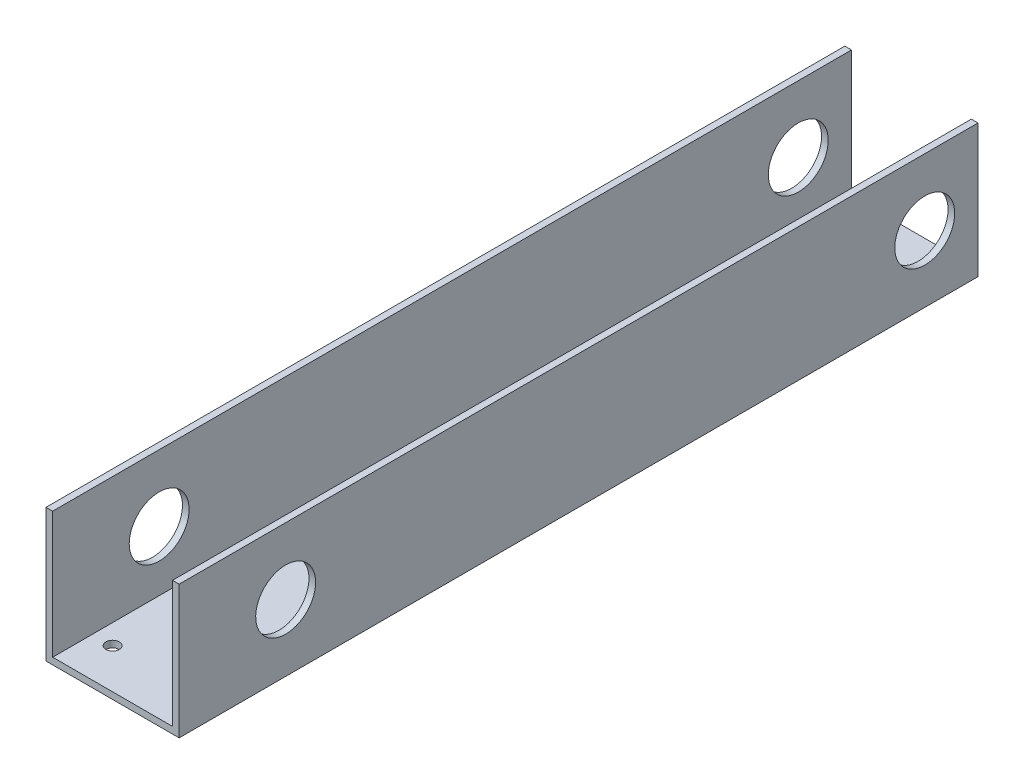
ISO-10303-21;
HEADER;
FILE_DESCRIPTION(('STEP AP214'),'2;1');
FILE_NAME('part.step','',(''),(''),'','','');
FILE_SCHEMA(('AUTOMOTIVE_DESIGN { 1 0 10303 214 1 1 1 1 }'));
ENDSEC;
DATA;
#1=APPLICATION_CONTEXT('core data for automotive mechanical design processes');
#2=APPLICATION_PROTOCOL_DEFINITION('international standard','automotive_design',2000,#1);
#3=PRODUCT_CONTEXT('',#1,'mechanical');
#4=PRODUCT('Part','Part','',(#3));
#5=PRODUCT_RELATED_PRODUCT_CATEGORY('part','',(#4));
#6=PRODUCT_DEFINITION_FORMATION('','',#4);
#7=PRODUCT_DEFINITION_CONTEXT('part definition',#1,'design');
#8=PRODUCT_DEFINITION('design','',#6,#7);
#9=PRODUCT_DEFINITION_SHAPE('','',#8);
#10=(LENGTH_UNIT() NAMED_UNIT(*) SI_UNIT(.MILLI.,.METRE.));
#11=(NAMED_UNIT(*) PLANE_ANGLE_UNIT() SI_UNIT($,.RADIAN.));
#12=(NAMED_UNIT(*) SI_UNIT($,.STERADIAN.) SOLID_ANGLE_UNIT());
#13=UNCERTAINTY_MEASURE_WITH_UNIT(LENGTH_MEASURE(1.E-05),#10,'distance_accuracy_value','');
#14=(GEOMETRIC_REPRESENTATION_CONTEXT(3) GLOBAL_UNCERTAINTY_ASSIGNED_CONTEXT((#13)) GLOBAL_UNIT_ASSIGNED_CONTEXT((#10,
#11,#12)) REPRESENTATION_CONTEXT('',''));
#15=CARTESIAN_POINT('',(0.,0.,0.));
#16=DIRECTION('',(0.,0.,1.));
#17=DIRECTION('',(1.,0.,0.));
#18=AXIS2_PLACEMENT_3D('',#15,#16,#17);
#19=CARTESIAN_POINT('',(0.,0.,381.));
#20=DIRECTION('',(1.,0.,0.));
#21=DIRECTION('',(0.,0.,-1.));
#22=AXIS2_PLACEMENT_3D('',#19,#20,#21);
#23=PLANE('',#22);
#24=CARTESIAN_POINT('',(0.,31.75,25.4));
#25=DIRECTION('',(1.,0.,0.));
#26=DIRECTION('',(0.,1.,0.));
#27=AXIS2_PLACEMENT_3D('',#24,#25,#26);
#28=CIRCLE('',#27,14.2875);
#29=CARTESIAN_POINT('',(0.,46.0375,25.4));
#30=VERTEX_POINT('',#29);
#31=EDGE_CURVE('E184',#30,#30,#28,.T.);
#32=ORIENTED_EDGE('',*,*,#31,.T.);
#33=EDGE_LOOP('',(#32));
#34=FACE_BOUND('',#33,.T.);
#35=CARTESIAN_POINT('',(0.,31.75,330.2));
#36=DIRECTION('',(1.,0.,0.));
#37=DIRECTION('',(0.,1.,0.));
#38=AXIS2_PLACEMENT_3D('',#35,#36,#37);
#39=CIRCLE('',#38,14.2875);
#40=CARTESIAN_POINT('',(0.,46.0375,330.2));
#41=VERTEX_POINT('',#40);
#42=EDGE_CURVE('E191',#41,#41,#39,.T.);
#43=ORIENTED_EDGE('',*,*,#42,.T.);
#44=EDGE_LOOP('',(#43));
#45=FACE_BOUND('',#44,.T.);
#46=DIRECTION('',(0.,-1.,0.));
#47=VECTOR('',#46,1.);
#48=CARTESIAN_POINT('',(0.,0.,0.));
#49=LINE('',#48,#47);
#50=CARTESIAN_POINT('',(0.,63.5,0.));
#51=VERTEX_POINT('',#50);
#52=CARTESIAN_POINT('',(0.,0.,0.));
#53=VERTEX_POINT('',#52);
#54=EDGE_CURVE('E131',#51,#53,#49,.T.);
#55=ORIENTED_EDGE('',*,*,#54,.T.);
#56=DIRECTION('',(0.,0.,-1.));
#57=VECTOR('',#56,1.);
#58=CARTESIAN_POINT('',(0.,0.,381.));
#59=LINE('',#58,#57);
#60=CARTESIAN_POINT('',(0.,0.,381.));
#61=VERTEX_POINT('',#60);
#62=EDGE_CURVE('E11',#61,#53,#59,.T.);
#63=ORIENTED_EDGE('',*,*,#62,.F.);
#64=DIRECTION('',(0.,-1.,0.));
#65=VECTOR('',#64,1.);
#66=CARTESIAN_POINT('',(0.,0.,381.));
#67=LINE('',#66,#65);
#68=CARTESIAN_POINT('',(0.,63.5,381.));
#69=VERTEX_POINT('',#68);
#70=EDGE_CURVE('E146',#69,#61,#67,.T.);
#71=ORIENTED_EDGE('',*,*,#70,.F.);
#72=DIRECTION('',(0.,0.,-1.));
#73=VECTOR('',#72,1.);
#74=CARTESIAN_POINT('',(0.,63.5,381.));
#75=LINE('',#74,#73);
#76=EDGE_CURVE('E127',#69,#51,#75,.T.);
#77=ORIENTED_EDGE('',*,*,#76,.T.);
#78=EDGE_LOOP('',(#55,#63,#71,#77));
#79=FACE_BOUND('',#78,.T.);
#80=ADVANCED_FACE('F33',(#34,#45,#79),#23,.F.);
#81=CARTESIAN_POINT('',(0.,0.,381.));
#82=DIRECTION('',(0.,1.,0.));
#83=DIRECTION('',(0.,0.,1.));
#84=AXIS2_PLACEMENT_3D('',#81,#82,#83);
#85=PLANE('',#84);
#86=CARTESIAN_POINT('',(12.7,0.,361.95));
#87=DIRECTION('',(0.,1.,0.));
#88=DIRECTION('',(0.,0.,1.));
#89=AXIS2_PLACEMENT_3D('',#86,#87,#88);
#90=CIRCLE('',#89,3.175);
#91=CARTESIAN_POINT('',(12.7,0.,365.125));
#92=VERTEX_POINT('',#91);
#93=EDGE_CURVE('E135',#92,#92,#90,.T.);
#94=ORIENTED_EDGE('',*,*,#93,.T.);
#95=EDGE_LOOP('',(#94));
#96=FACE_BOUND('',#95,.T.);
#97=CARTESIAN_POINT('',(50.8,0.,361.95));
#98=DIRECTION('',(0.,1.,0.));
#99=DIRECTION('',(0.,0.,1.));
#100=AXIS2_PLACEMENT_3D('',#97,#98,#99);
#101=CIRCLE('',#100,3.175);
#102=CARTESIAN_POINT('',(50.8,0.,365.125));
#103=VERTEX_POINT('',#102);
#104=EDGE_CURVE('E178',#103,#103,#101,.T.);
#105=ORIENTED_EDGE('',*,*,#104,.T.);
#106=EDGE_LOOP('',(#105));
#107=FACE_BOUND('',#106,.T.);
#108=CARTESIAN_POINT('',(50.8,0.,285.75));
#109=DIRECTION('',(0.,1.,0.));
#110=DIRECTION('',(0.,0.,1.));
#111=AXIS2_PLACEMENT_3D('',#108,#109,#110);
#112=CIRCLE('',#111,3.175);
#113=CARTESIAN_POINT('',(50.8,0.,288.925));
#114=VERTEX_POINT('',#113);
#115=EDGE_CURVE('E174',#114,#114,#112,.T.);
#116=ORIENTED_EDGE('',*,*,#115,.T.);
#117=EDGE_LOOP('',(#116));
#118=FACE_BOUND('',#117,.T.);
#119=CARTESIAN_POINT('',(50.8,0.,209.55));
#120=DIRECTION('',(0.,1.,0.));
#121=DIRECTION('',(0.,0.,1.));
#122=AXIS2_PLACEMENT_3D('',#119,#120,#121);
#123=CIRCLE('',#122,3.175);
#124=CARTESIAN_POINT('',(50.8,0.,212.725));
#125=VERTEX_POINT('',#124);
#126=EDGE_CURVE('E170',#125,#125,#123,.T.);
#127=ORIENTED_EDGE('',*,*,#126,.T.);
#128=EDGE_LOOP('',(#127));
#129=FACE_BOUND('',#128,.T.);
#130=CARTESIAN_POINT('',(50.8,0.,133.35));
#131=DIRECTION('',(0.,1.,0.));
#132=DIRECTION('',(0.,0.,1.));
#133=AXIS2_PLACEMENT_3D('',#130,#131,#132);
#134=CIRCLE('',#133,3.175);
#135=CARTESIAN_POINT('',(50.8,0.,136.525));
#136=VERTEX_POINT('',#135);
#137=EDGE_CURVE('E166',#136,#136,#134,.T.);
#138=ORIENTED_EDGE('',*,*,#137,.T.);
#139=EDGE_LOOP('',(#138));
#140=FACE_BOUND('',#139,.T.);
#141=CARTESIAN_POINT('',(50.8,0.,57.15));
#142=DIRECTION('',(0.,1.,0.));
#143=DIRECTION('',(0.,0.,1.));
#144=AXIS2_PLACEMENT_3D('',#141,#142,#143);
#145=CIRCLE('',#144,3.175);
#146=CARTESIAN_POINT('',(50.8,0.,60.325));
#147=VERTEX_POINT('',#146);
#148=EDGE_CURVE('E161',#147,#147,#145,.T.);
#149=ORIENTED_EDGE('',*,*,#148,.T.);
#150=EDGE_LOOP('',(#149));
#151=FACE_BOUND('',#150,.T.);
#152=DIRECTION('',(1.,0.,0.));
#153=VECTOR('',#152,1.);
#154=CARTESIAN_POINT('',(0.,0.,0.));
#155=LINE('',#154,#153);
#156=CARTESIAN_POINT('',(63.5,0.,0.));
#157=VERTEX_POINT('',#156);
#158=EDGE_CURVE('E134',#53,#157,#155,.T.);
#159=ORIENTED_EDGE('',*,*,#158,.T.);
#160=DIRECTION('',(0.,0.,-1.));
#161=VECTOR('',#160,1.);
#162=CARTESIAN_POINT('',(63.5,0.,381.));
#163=LINE('',#162,#161);
#164=CARTESIAN_POINT('',(63.5,0.,381.));
#165=VERTEX_POINT('',#164);
#166=EDGE_CURVE('E42',#165,#157,#163,.T.);
#167=ORIENTED_EDGE('',*,*,#166,.F.);
#168=DIRECTION('',(1.,0.,0.));
#169=VECTOR('',#168,1.);
#170=CARTESIAN_POINT('',(0.,0.,381.));
#171=LINE('',#170,#169);
#172=EDGE_CURVE('E94',#61,#165,#171,.T.);
#173=ORIENTED_EDGE('',*,*,#172,.F.);
#174=ORIENTED_EDGE('',*,*,#62,.T.);
#175=EDGE_LOOP('',(#159,#167,#173,#174));
#176=FACE_BOUND('',#175,.T.);
#177=ADVANCED_FACE('F252',(#96,#107,#118,#129,#140,#151,#176),#85,.F.);
#178=CARTESIAN_POINT('',(63.5,63.5,381.));
#179=DIRECTION('',(-1.,0.,0.));
#180=DIRECTION('',(0.,-1.,0.));
#181=AXIS2_PLACEMENT_3D('',#178,#179,#180);
#182=PLANE('',#181);
#183=CARTESIAN_POINT('',(63.5,31.75,25.4));
#184=DIRECTION('',(-1.,0.,0.));
#185=DIRECTION('',(0.,-1.,0.));
#186=AXIS2_PLACEMENT_3D('',#183,#184,#185);
#187=CIRCLE('',#186,14.2875);
#188=CARTESIAN_POINT('',(63.5,17.4625,25.4));
#189=VERTEX_POINT('',#188);
#190=EDGE_CURVE('E162',#189,#189,#187,.T.);
#191=ORIENTED_EDGE('',*,*,#190,.T.);
#192=EDGE_LOOP('',(#191));
#193=FACE_BOUND('',#192,.T.);
#194=CARTESIAN_POINT('',(63.5,31.75,330.2));
#195=DIRECTION('',(-1.,0.,0.));
#196=DIRECTION('',(0.,-1.,0.));
#197=AXIS2_PLACEMENT_3D('',#194,#195,#196);
#198=CIRCLE('',#197,14.2875);
#199=CARTESIAN_POINT('',(63.5,17.4624999999999,330.2));
#200=VERTEX_POINT('',#199);
#201=EDGE_CURVE('E188',#200,#200,#198,.T.);
#202=ORIENTED_EDGE('',*,*,#201,.T.);
#203=EDGE_LOOP('',(#202));
#204=FACE_BOUND('',#203,.T.);
#205=DIRECTION('',(0.,1.,0.));
#206=VECTOR('',#205,1.);
#207=CARTESIAN_POINT('',(63.5,63.5,0.));
#208=LINE('',#207,#206);
#209=CARTESIAN_POINT('',(63.5,63.5,0.));
#210=VERTEX_POINT('',#209);
#211=EDGE_CURVE('E137',#157,#210,#208,.T.);
#212=ORIENTED_EDGE('',*,*,#211,.T.);
#213=DIRECTION('',(0.,0.,-1.));
#214=VECTOR('',#213,1.);
#215=CARTESIAN_POINT('',(63.5,63.5,381.));
#216=LINE('',#215,#214);
#217=CARTESIAN_POINT('',(63.5,63.5,381.));
#218=VERTEX_POINT('',#217);
#219=EDGE_CURVE('E153',#218,#210,#216,.T.);
#220=ORIENTED_EDGE('',*,*,#219,.F.);
#221=DIRECTION('',(0.,1.,0.));
#222=VECTOR('',#221,1.);
#223=CARTESIAN_POINT('',(63.5,63.5,381.));
#224=LINE('',#223,#222);
#225=EDGE_CURVE('E219',#165,#218,#224,.T.);
#226=ORIENTED_EDGE('',*,*,#225,.F.);
#227=ORIENTED_EDGE('',*,*,#166,.T.);
#228=EDGE_LOOP('',(#212,#220,#226,#227));
#229=FACE_BOUND('',#228,.T.);
#230=ADVANCED_FACE('F258',(#193,#204,#229),#182,.F.);
#231=CARTESIAN_POINT('',(60.325,63.5,381.));
#232=DIRECTION('',(0.,-1.,0.));
#233=DIRECTION('',(0.,0.,-1.));
#234=AXIS2_PLACEMENT_3D('',#231,#232,#233);
#235=PLANE('',#234);
#236=DIRECTION('',(-1.,0.,0.));
#237=VECTOR('',#236,1.);
#238=CARTESIAN_POINT('',(60.325,63.5,0.));
#239=LINE('',#238,#237);
#240=CARTESIAN_POINT('',(60.325,63.5,0.));
#241=VERTEX_POINT('',#240);
#242=EDGE_CURVE('E139',#210,#241,#239,.T.);
#243=ORIENTED_EDGE('',*,*,#242,.T.);
#244=DIRECTION('',(0.,0.,-1.));
#245=VECTOR('',#244,1.);
#246=CARTESIAN_POINT('',(60.325,63.5,381.));
#247=LINE('',#246,#245);
#248=CARTESIAN_POINT('',(60.325,63.5,381.));
#249=VERTEX_POINT('',#248);
#250=EDGE_CURVE('E150',#249,#241,#247,.T.);
#251=ORIENTED_EDGE('',*,*,#250,.F.);
#252=DIRECTION('',(-1.,0.,0.));
#253=VECTOR('',#252,1.);
#254=CARTESIAN_POINT('',(60.325,63.5,381.));
#255=LINE('',#254,#253);
#256=EDGE_CURVE('E221',#218,#249,#255,.T.);
#257=ORIENTED_EDGE('',*,*,#256,.F.);
#258=ORIENTED_EDGE('',*,*,#219,.T.);
#259=EDGE_LOOP('',(#243,#251,#257,#258));
#260=FACE_BOUND('',#259,.T.);
#261=ADVANCED_FACE('F227',(#260),#235,.F.);
#262=CARTESIAN_POINT('',(60.325,3.175,381.));
#263=DIRECTION('',(1.,0.,0.));
#264=DIRECTION('',(0.,0.,-1.));
#265=AXIS2_PLACEMENT_3D('',#262,#263,#264);
#266=PLANE('',#265);
#267=CARTESIAN_POINT('',(60.325,31.75,25.4));
#268=DIRECTION('',(1.,0.,0.));
#269=DIRECTION('',(0.,0.,-1.));
#270=AXIS2_PLACEMENT_3D('',#267,#268,#269);
#271=CIRCLE('',#270,14.2875);
#272=CARTESIAN_POINT('',(60.325,31.75,11.1125));
#273=VERTEX_POINT('',#272);
#274=EDGE_CURVE('E200',#273,#273,#271,.T.);
#275=ORIENTED_EDGE('',*,*,#274,.T.);
#276=EDGE_LOOP('',(#275));
#277=FACE_BOUND('',#276,.T.);
#278=CARTESIAN_POINT('',(60.325,31.75,330.2));
#279=DIRECTION('',(1.,0.,0.));
#280=DIRECTION('',(0.,0.,-1.));
#281=AXIS2_PLACEMENT_3D('',#278,#279,#280);
#282=CIRCLE('',#281,14.2875);
#283=CARTESIAN_POINT('',(60.325,31.75,315.9125));
#284=VERTEX_POINT('',#283);
#285=EDGE_CURVE('E183',#284,#284,#282,.T.);
#286=ORIENTED_EDGE('',*,*,#285,.T.);
#287=EDGE_LOOP('',(#286));
#288=FACE_BOUND('',#287,.T.);
#289=DIRECTION('',(0.,-1.,0.));
#290=VECTOR('',#289,1.);
#291=CARTESIAN_POINT('',(60.325,3.175,0.));
#292=LINE('',#291,#290);
#293=CARTESIAN_POINT('',(60.325,3.175,0.));
#294=VERTEX_POINT('',#293);
#295=EDGE_CURVE('E141',#241,#294,#292,.T.);
#296=ORIENTED_EDGE('',*,*,#295,.T.);
#297=DIRECTION('',(0.,0.,-1.));
#298=VECTOR('',#297,1.);
#299=CARTESIAN_POINT('',(60.325,3.175,381.));
#300=LINE('',#299,#298);
#301=CARTESIAN_POINT('',(60.325,3.175,381.));
#302=VERTEX_POINT('',#301);
#303=EDGE_CURVE('E122',#302,#294,#300,.T.);
#304=ORIENTED_EDGE('',*,*,#303,.F.);
#305=DIRECTION('',(0.,-1.,0.));
#306=VECTOR('',#305,1.);
#307=CARTESIAN_POINT('',(60.325,3.175,381.));
#308=LINE('',#307,#306);
#309=EDGE_CURVE('E113',#249,#302,#308,.T.);
#310=ORIENTED_EDGE('',*,*,#309,.F.);
#311=ORIENTED_EDGE('',*,*,#250,.T.);
#312=EDGE_LOOP('',(#296,#304,#310,#311));
#313=FACE_BOUND('',#312,.T.);
#314=ADVANCED_FACE('F231',(#277,#288,#313),#266,.F.);
#315=CARTESIAN_POINT('',(3.17500000000001,3.175,381.));
#316=DIRECTION('',(0.,-1.,0.));
#317=DIRECTION('',(1.,0.,0.));
#318=AXIS2_PLACEMENT_3D('',#315,#316,#317);
#319=PLANE('',#318);
#320=CARTESIAN_POINT('',(12.7,3.175,361.95));
#321=DIRECTION('',(0.,-1.,0.));
#322=DIRECTION('',(1.,0.,0.));
#323=AXIS2_PLACEMENT_3D('',#320,#321,#322);
#324=CIRCLE('',#323,3.175);
#325=CARTESIAN_POINT('',(15.875,3.175,361.95));
#326=VERTEX_POINT('',#325);
#327=EDGE_CURVE('E179',#326,#326,#324,.T.);
#328=ORIENTED_EDGE('',*,*,#327,.T.);
#329=EDGE_LOOP('',(#328));
#330=FACE_BOUND('',#329,.T.);
#331=CARTESIAN_POINT('',(50.8,3.175,361.95));
#332=DIRECTION('',(0.,-1.,0.));
#333=DIRECTION('',(1.,0.,0.));
#334=AXIS2_PLACEMENT_3D('',#331,#332,#333);
#335=CIRCLE('',#334,3.175);
#336=CARTESIAN_POINT('',(53.975,3.175,361.95));
#337=VERTEX_POINT('',#336);
#338=EDGE_CURVE('E175',#337,#337,#335,.T.);
#339=ORIENTED_EDGE('',*,*,#338,.T.);
#340=EDGE_LOOP('',(#339));
#341=FACE_BOUND('',#340,.T.);
#342=CARTESIAN_POINT('',(50.8,3.175,285.75));
#343=DIRECTION('',(0.,-1.,0.));
#344=DIRECTION('',(1.,0.,0.));
#345=AXIS2_PLACEMENT_3D('',#342,#343,#344);
#346=CIRCLE('',#345,3.175);
#347=CARTESIAN_POINT('',(53.975,3.175,285.75));
#348=VERTEX_POINT('',#347);
#349=EDGE_CURVE('E171',#348,#348,#346,.T.);
#350=ORIENTED_EDGE('',*,*,#349,.T.);
#351=EDGE_LOOP('',(#350));
#352=FACE_BOUND('',#351,.T.);
#353=CARTESIAN_POINT('',(50.8,3.175,209.55));
#354=DIRECTION('',(0.,-1.,0.));
#355=DIRECTION('',(1.,0.,0.));
#356=AXIS2_PLACEMENT_3D('',#353,#354,#355);
#357=CIRCLE('',#356,3.175);
#358=CARTESIAN_POINT('',(53.975,3.175,209.55));
#359=VERTEX_POINT('',#358);
#360=EDGE_CURVE('E167',#359,#359,#357,.T.);
#361=ORIENTED_EDGE('',*,*,#360,.T.);
#362=EDGE_LOOP('',(#361));
#363=FACE_BOUND('',#362,.T.);
#364=CARTESIAN_POINT('',(50.8,3.175,133.35));
#365=DIRECTION('',(0.,-1.,0.));
#366=DIRECTION('',(1.,0.,0.));
#367=AXIS2_PLACEMENT_3D('',#364,#365,#366);
#368=CIRCLE('',#367,3.175);
#369=CARTESIAN_POINT('',(53.975,3.175,133.35));
#370=VERTEX_POINT('',#369);
#371=EDGE_CURVE('E163',#370,#370,#368,.T.);
#372=ORIENTED_EDGE('',*,*,#371,.T.);
#373=EDGE_LOOP('',(#372));
#374=FACE_BOUND('',#373,.T.);
#375=CARTESIAN_POINT('',(50.8,3.175,57.15));
#376=DIRECTION('',(0.,-1.,0.));
#377=DIRECTION('',(1.,0.,0.));
#378=AXIS2_PLACEMENT_3D('',#375,#376,#377);
#379=CIRCLE('',#378,3.175);
#380=CARTESIAN_POINT('',(53.975,3.175,57.15));
#381=VERTEX_POINT('',#380);
#382=EDGE_CURVE('E158',#381,#381,#379,.T.);
#383=ORIENTED_EDGE('',*,*,#382,.T.);
#384=EDGE_LOOP('',(#383));
#385=FACE_BOUND('',#384,.T.);
#386=DIRECTION('',(-1.,0.,0.));
#387=VECTOR('',#386,1.);
#388=CARTESIAN_POINT('',(3.17500000000001,3.175,0.));
#389=LINE('',#388,#387);
#390=CARTESIAN_POINT('',(3.17500000000001,3.175,0.));
#391=VERTEX_POINT('',#390);
#392=EDGE_CURVE('E121',#294,#391,#389,.T.);
#393=ORIENTED_EDGE('',*,*,#392,.T.);
#394=DIRECTION('',(0.,0.,-1.));
#395=VECTOR('',#394,1.);
#396=CARTESIAN_POINT('',(3.17500000000001,3.175,381.));
#397=LINE('',#396,#395);
#398=CARTESIAN_POINT('',(3.17500000000001,3.175,381.));
#399=VERTEX_POINT('',#398);
#400=EDGE_CURVE('E118',#399,#391,#397,.T.);
#401=ORIENTED_EDGE('',*,*,#400,.F.);
#402=DIRECTION('',(-1.,0.,0.));
#403=VECTOR('',#402,1.);
#404=CARTESIAN_POINT('',(3.17500000000001,3.175,381.));
#405=LINE('',#404,#403);
#406=EDGE_CURVE('E107',#302,#399,#405,.T.);
#407=ORIENTED_EDGE('',*,*,#406,.F.);
#408=ORIENTED_EDGE('',*,*,#303,.T.);
#409=EDGE_LOOP('',(#393,#401,#407,#408));
#410=FACE_BOUND('',#409,.T.);
#411=ADVANCED_FACE('F119',(#330,#341,#352,#363,#374,#385,#410),#319,.F.);
#412=CARTESIAN_POINT('',(3.175,63.5,381.));
#413=DIRECTION('',(-1.,0.,0.));
#414=DIRECTION('',(0.,-1.,0.));
#415=AXIS2_PLACEMENT_3D('',#412,#413,#414);
#416=PLANE('',#415);
#417=CARTESIAN_POINT('',(3.175,31.75,25.4));
#418=DIRECTION('',(-1.,0.,0.));
#419=DIRECTION('',(0.,-1.,0.));
#420=AXIS2_PLACEMENT_3D('',#417,#418,#419);
#421=CIRCLE('',#420,14.2875);
#422=CARTESIAN_POINT('',(3.17500000000001,17.4625,25.4));
#423=VERTEX_POINT('',#422);
#424=EDGE_CURVE('E36',#423,#423,#421,.T.);
#425=ORIENTED_EDGE('',*,*,#424,.T.);
#426=EDGE_LOOP('',(#425));
#427=FACE_BOUND('',#426,.T.);
#428=CARTESIAN_POINT('',(3.175,31.75,330.2));
#429=DIRECTION('',(-1.,0.,0.));
#430=DIRECTION('',(0.,-1.,0.));
#431=AXIS2_PLACEMENT_3D('',#428,#429,#430);
#432=CIRCLE('',#431,14.2875);
#433=CARTESIAN_POINT('',(3.17500000000001,17.4624999999999,330.2));
#434=VERTEX_POINT('',#433);
#435=EDGE_CURVE('E181',#434,#434,#432,.T.);
#436=ORIENTED_EDGE('',*,*,#435,.T.);
#437=EDGE_LOOP('',(#436));
#438=FACE_BOUND('',#437,.T.);
#439=DIRECTION('',(0.,1.,0.));
#440=VECTOR('',#439,1.);
#441=CARTESIAN_POINT('',(3.175,63.5,0.));
#442=LINE('',#441,#440);
#443=CARTESIAN_POINT('',(3.175,63.5,0.));
#444=VERTEX_POINT('',#443);
#445=EDGE_CURVE('E80',#391,#444,#442,.T.);
#446=ORIENTED_EDGE('',*,*,#445,.T.);
#447=DIRECTION('',(0.,0.,-1.));
#448=VECTOR('',#447,1.);
#449=CARTESIAN_POINT('',(3.175,63.5,381.));
#450=LINE('',#449,#448);
#451=CARTESIAN_POINT('',(3.175,63.5,381.));
#452=VERTEX_POINT('',#451);
#453=EDGE_CURVE('E123',#452,#444,#450,.T.);
#454=ORIENTED_EDGE('',*,*,#453,.F.);
#455=DIRECTION('',(0.,1.,0.));
#456=VECTOR('',#455,1.);
#457=CARTESIAN_POINT('',(3.175,63.5,381.));
#458=LINE('',#457,#456);
#459=EDGE_CURVE('E111',#399,#452,#458,.T.);
#460=ORIENTED_EDGE('',*,*,#459,.F.);
#461=ORIENTED_EDGE('',*,*,#400,.T.);
#462=EDGE_LOOP('',(#446,#454,#460,#461));
#463=FACE_BOUND('',#462,.T.);
#464=ADVANCED_FACE('F125',(#427,#438,#463),#416,.F.);
#465=CARTESIAN_POINT('',(0.,63.5,381.));
#466=DIRECTION('',(0.,-1.,0.));
#467=DIRECTION('',(0.,0.,-1.));
#468=AXIS2_PLACEMENT_3D('',#465,#466,#467);
#469=PLANE('',#468);
#470=DIRECTION('',(-1.,0.,0.));
#471=VECTOR('',#470,1.);
#472=CARTESIAN_POINT('',(0.,63.5,0.));
#473=LINE('',#472,#471);
#474=EDGE_CURVE('E86',#444,#51,#473,.T.);
#475=ORIENTED_EDGE('',*,*,#474,.T.);
#476=ORIENTED_EDGE('',*,*,#76,.F.);
#477=DIRECTION('',(-1.,0.,0.));
#478=VECTOR('',#477,1.);
#479=CARTESIAN_POINT('',(0.,63.5,381.));
#480=LINE('',#479,#478);
#481=EDGE_CURVE('E51',#452,#69,#480,.T.);
#482=ORIENTED_EDGE('',*,*,#481,.F.);
#483=ORIENTED_EDGE('',*,*,#453,.T.);
#484=EDGE_LOOP('',(#475,#476,#482,#483));
#485=FACE_BOUND('',#484,.T.);
#486=ADVANCED_FACE('F239',(#485),#469,.F.);
#487=CARTESIAN_POINT('',(0.,0.,381.));
#488=DIRECTION('',(0.,0.,-1.));
#489=DIRECTION('',(-1.,0.,0.));
#490=AXIS2_PLACEMENT_3D('',#487,#488,#489);
#491=PLANE('',#490);
#492=ORIENTED_EDGE('',*,*,#70,.T.);
#493=ORIENTED_EDGE('',*,*,#172,.T.);
#494=ORIENTED_EDGE('',*,*,#225,.T.);
#495=ORIENTED_EDGE('',*,*,#256,.T.);
#496=ORIENTED_EDGE('',*,*,#309,.T.);
#497=ORIENTED_EDGE('',*,*,#406,.T.);
#498=ORIENTED_EDGE('',*,*,#459,.T.);
#499=ORIENTED_EDGE('',*,*,#481,.T.);
#500=EDGE_LOOP('',(#492,#493,#494,#495,#496,#497,#498,#499));
#501=FACE_BOUND('',#500,.T.);
#502=ADVANCED_FACE('F109',(#501),#491,.F.);
#503=CARTESIAN_POINT('',(0.,0.,0.));
#504=DIRECTION('',(0.,0.,-1.));
#505=DIRECTION('',(-1.,0.,0.));
#506=AXIS2_PLACEMENT_3D('',#503,#504,#505);
#507=PLANE('',#506);
#508=ORIENTED_EDGE('',*,*,#54,.F.);
#509=ORIENTED_EDGE('',*,*,#474,.F.);
#510=ORIENTED_EDGE('',*,*,#445,.F.);
#511=ORIENTED_EDGE('',*,*,#392,.F.);
#512=ORIENTED_EDGE('',*,*,#295,.F.);
#513=ORIENTED_EDGE('',*,*,#242,.F.);
#514=ORIENTED_EDGE('',*,*,#211,.F.);
#515=ORIENTED_EDGE('',*,*,#158,.F.);
#516=EDGE_LOOP('',(#508,#509,#510,#511,#512,#513,#514,#515));
#517=FACE_BOUND('',#516,.T.);
#518=ADVANCED_FACE('F234',(#517),#507,.T.);
#519=CARTESIAN_POINT('',(50.8,63.5,57.15));
#520=DIRECTION('',(0.,-1.,0.));
#521=DIRECTION('',(0.,0.,-1.));
#522=AXIS2_PLACEMENT_3D('',#519,#520,#521);
#523=CYLINDRICAL_SURFACE('',#522,3.175);
#524=ORIENTED_EDGE('',*,*,#382,.F.);
#525=EDGE_LOOP('',(#524));
#526=FACE_BOUND('',#525,.T.);
#527=ORIENTED_EDGE('',*,*,#148,.F.);
#528=EDGE_LOOP('',(#527));
#529=FACE_BOUND('',#528,.T.);
#530=ADVANCED_FACE('F318',(#526,#529),#523,.F.);
#531=CARTESIAN_POINT('',(50.8,63.5,133.35));
#532=DIRECTION('',(0.,-1.,0.));
#533=DIRECTION('',(0.,0.,-1.));
#534=AXIS2_PLACEMENT_3D('',#531,#532,#533);
#535=CYLINDRICAL_SURFACE('',#534,3.175);
#536=ORIENTED_EDGE('',*,*,#371,.F.);
#537=EDGE_LOOP('',(#536));
#538=FACE_BOUND('',#537,.T.);
#539=ORIENTED_EDGE('',*,*,#137,.F.);
#540=EDGE_LOOP('',(#539));
#541=FACE_BOUND('',#540,.T.);
#542=ADVANCED_FACE('F321',(#538,#541),#535,.F.);
#543=CARTESIAN_POINT('',(50.8,63.5,209.55));
#544=DIRECTION('',(0.,-1.,0.));
#545=DIRECTION('',(0.,0.,-1.));
#546=AXIS2_PLACEMENT_3D('',#543,#544,#545);
#547=CYLINDRICAL_SURFACE('',#546,3.175);
#548=ORIENTED_EDGE('',*,*,#360,.F.);
#549=EDGE_LOOP('',(#548));
#550=FACE_BOUND('',#549,.T.);
#551=ORIENTED_EDGE('',*,*,#126,.F.);
#552=EDGE_LOOP('',(#551));
#553=FACE_BOUND('',#552,.T.);
#554=ADVANCED_FACE('F328',(#550,#553),#547,.F.);
#555=CARTESIAN_POINT('',(50.8,63.5,285.75));
#556=DIRECTION('',(0.,-1.,0.));
#557=DIRECTION('',(0.,0.,-1.));
#558=AXIS2_PLACEMENT_3D('',#555,#556,#557);
#559=CYLINDRICAL_SURFACE('',#558,3.175);
#560=ORIENTED_EDGE('',*,*,#349,.F.);
#561=EDGE_LOOP('',(#560));
#562=FACE_BOUND('',#561,.T.);
#563=ORIENTED_EDGE('',*,*,#115,.F.);
#564=EDGE_LOOP('',(#563));
#565=FACE_BOUND('',#564,.T.);
#566=ADVANCED_FACE('F334',(#562,#565),#559,.F.);
#567=CARTESIAN_POINT('',(50.8,63.5,361.95));
#568=DIRECTION('',(0.,-1.,0.));
#569=DIRECTION('',(0.,0.,-1.));
#570=AXIS2_PLACEMENT_3D('',#567,#568,#569);
#571=CYLINDRICAL_SURFACE('',#570,3.175);
#572=ORIENTED_EDGE('',*,*,#338,.F.);
#573=EDGE_LOOP('',(#572));
#574=FACE_BOUND('',#573,.T.);
#575=ORIENTED_EDGE('',*,*,#104,.F.);
#576=EDGE_LOOP('',(#575));
#577=FACE_BOUND('',#576,.T.);
#578=ADVANCED_FACE('F277',(#574,#577),#571,.F.);
#579=CARTESIAN_POINT('',(12.7,63.5,361.95));
#580=DIRECTION('',(0.,-1.,0.));
#581=DIRECTION('',(0.,0.,-1.));
#582=AXIS2_PLACEMENT_3D('',#579,#580,#581);
#583=CYLINDRICAL_SURFACE('',#582,3.175);
#584=ORIENTED_EDGE('',*,*,#327,.F.);
#585=EDGE_LOOP('',(#584));
#586=FACE_BOUND('',#585,.T.);
#587=ORIENTED_EDGE('',*,*,#93,.F.);
#588=EDGE_LOOP('',(#587));
#589=FACE_BOUND('',#588,.T.);
#590=ADVANCED_FACE('F267',(#586,#589),#583,.F.);
#591=CARTESIAN_POINT('',(0.,31.75,330.2));
#592=DIRECTION('',(1.,0.,0.));
#593=DIRECTION('',(0.,1.,0.));
#594=AXIS2_PLACEMENT_3D('',#591,#592,#593);
#595=CYLINDRICAL_SURFACE('',#594,14.2875);
#596=ORIENTED_EDGE('',*,*,#42,.F.);
#597=EDGE_LOOP('',(#596));
#598=FACE_BOUND('',#597,.T.);
#599=ORIENTED_EDGE('',*,*,#435,.F.);
#600=EDGE_LOOP('',(#599));
#601=FACE_BOUND('',#600,.T.);
#602=ADVANCED_FACE('F263',(#598,#601),#595,.F.);
#603=CARTESIAN_POINT('',(0.,31.75,25.4));
#604=DIRECTION('',(1.,0.,0.));
#605=DIRECTION('',(0.,1.,0.));
#606=AXIS2_PLACEMENT_3D('',#603,#604,#605);
#607=CYLINDRICAL_SURFACE('',#606,14.2875);
#608=ORIENTED_EDGE('',*,*,#31,.F.);
#609=EDGE_LOOP('',(#608));
#610=FACE_BOUND('',#609,.T.);
#611=ORIENTED_EDGE('',*,*,#424,.F.);
#612=EDGE_LOOP('',(#611));
#613=FACE_BOUND('',#612,.T.);
#614=ADVANCED_FACE('F266',(#610,#613),#607,.F.);
#615=ORIENTED_EDGE('',*,*,#285,.F.);
#616=EDGE_LOOP('',(#615));
#617=FACE_BOUND('',#616,.T.);
#618=ORIENTED_EDGE('',*,*,#201,.F.);
#619=EDGE_LOOP('',(#618));
#620=FACE_BOUND('',#619,.T.);
#621=ADVANCED_FACE('F269',(#617,#620),#595,.F.);
#622=ORIENTED_EDGE('',*,*,#274,.F.);
#623=EDGE_LOOP('',(#622));
#624=FACE_BOUND('',#623,.T.);
#625=ORIENTED_EDGE('',*,*,#190,.F.);
#626=EDGE_LOOP('',(#625));
#627=FACE_BOUND('',#626,.T.);
#628=ADVANCED_FACE('F276',(#624,#627),#607,.F.);
#629=CLOSED_SHELL('',(#80,#177,#230,#261,#314,#411,#464,#486,#502,#518,#530,#542,#554,#566,#578,
#590,#602,#614,#621,#628));
#630=MANIFOLD_SOLID_BREP('B2',#629);
#631=ADVANCED_BREP_SHAPE_REPRESENTATION('',(#18,#630),#14);
#632=SHAPE_DEFINITION_REPRESENTATION(#9,#631);
ENDSEC;
END-ISO-10303-21;
